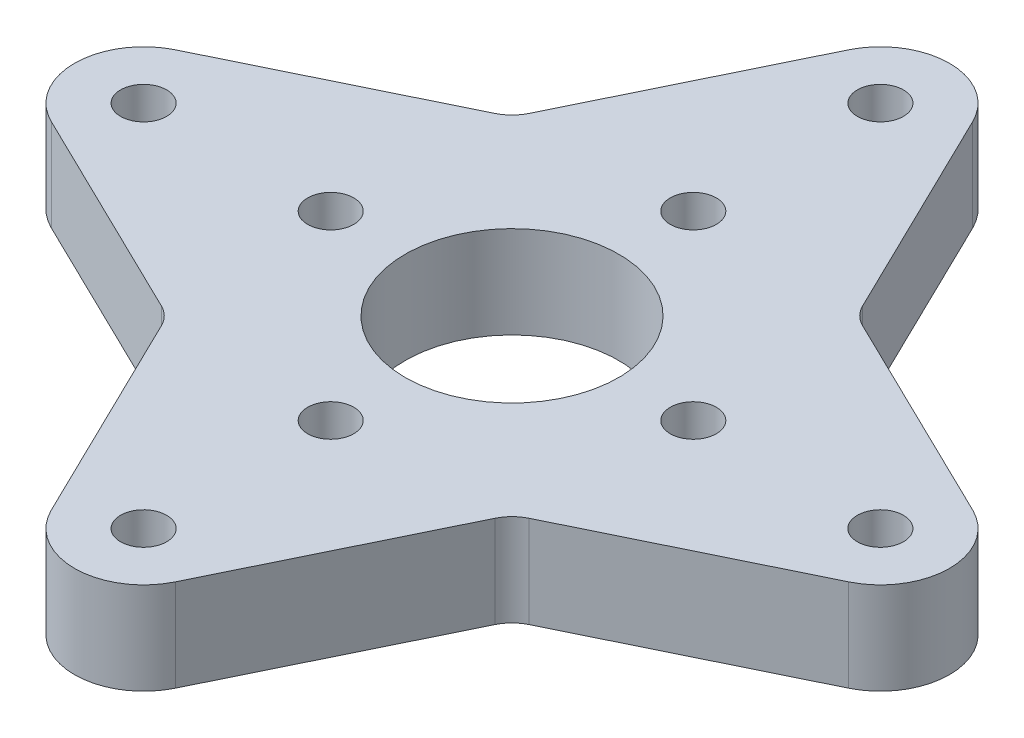
ISO-10303-21;
HEADER;
FILE_DESCRIPTION(('STEP AP214'),'2;1');
FILE_NAME('part.step','',(''),(''),'','','');
FILE_SCHEMA(('AUTOMOTIVE_DESIGN { 1 0 10303 214 1 1 1 1 }'));
ENDSEC;
DATA;
#1=APPLICATION_CONTEXT('core data for automotive mechanical design processes');
#2=APPLICATION_PROTOCOL_DEFINITION('international standard','automotive_design',2000,#1);
#3=PRODUCT_CONTEXT('',#1,'mechanical');
#4=PRODUCT('Part','Part','',(#3));
#5=PRODUCT_RELATED_PRODUCT_CATEGORY('part','',(#4));
#6=PRODUCT_DEFINITION_FORMATION('','',#4);
#7=PRODUCT_DEFINITION_CONTEXT('part definition',#1,'design');
#8=PRODUCT_DEFINITION('design','',#6,#7);
#9=PRODUCT_DEFINITION_SHAPE('','',#8);
#10=(LENGTH_UNIT() NAMED_UNIT(*) SI_UNIT(.MILLI.,.METRE.));
#11=(NAMED_UNIT(*) PLANE_ANGLE_UNIT() SI_UNIT($,.RADIAN.));
#12=(NAMED_UNIT(*) SI_UNIT($,.STERADIAN.) SOLID_ANGLE_UNIT());
#13=UNCERTAINTY_MEASURE_WITH_UNIT(LENGTH_MEASURE(1.E-05),#10,'distance_accuracy_value','');
#14=(GEOMETRIC_REPRESENTATION_CONTEXT(3) GLOBAL_UNCERTAINTY_ASSIGNED_CONTEXT((#13)) GLOBAL_UNIT_ASSIGNED_CONTEXT((#10,
#11,#12)) REPRESENTATION_CONTEXT('',''));
#15=CARTESIAN_POINT('',(0.,0.,0.));
#16=DIRECTION('',(0.,0.,1.));
#17=DIRECTION('',(1.,0.,0.));
#18=AXIS2_PLACEMENT_3D('',#15,#16,#17);
#19=CARTESIAN_POINT('',(13.7833926033585,6.35,13.7833926033584));
#20=DIRECTION('',(0.,1.,0.));
#21=DIRECTION('',(0.,0.,1.));
#22=AXIS2_PLACEMENT_3D('',#19,#20,#21);
#23=PLANE('',#22);
#24=CARTESIAN_POINT('',(-12.5,6.35,-1.50920942409982E-13));
#25=DIRECTION('',(0.,1.,0.));
#26=DIRECTION('',(0.,0.,-1.));
#27=AXIS2_PLACEMENT_3D('',#24,#25,#26);
#28=CIRCLE('',#27,1.5875);
#29=CARTESIAN_POINT('',(-12.5,6.35,-1.58750000000015));
#30=VERTEX_POINT('',#29);
#31=EDGE_CURVE('E311',#30,#30,#28,.T.);
#32=ORIENTED_EDGE('',*,*,#31,.F.);
#33=EDGE_LOOP('',(#32));
#34=FACE_BOUND('',#33,.T.);
#35=CARTESIAN_POINT('',(-2.4980018054066E-13,6.35,25.4));
#36=DIRECTION('',(0.,1.,0.));
#37=DIRECTION('',(0.,0.,-1.));
#38=AXIS2_PLACEMENT_3D('',#35,#36,#37);
#39=CIRCLE('',#38,1.58750000000005);
#40=CARTESIAN_POINT('',(-2.4980018054066E-13,6.35,23.8124999999999));
#41=VERTEX_POINT('',#40);
#42=EDGE_CURVE('E319',#41,#41,#39,.T.);
#43=ORIENTED_EDGE('',*,*,#42,.F.);
#44=EDGE_LOOP('',(#43));
#45=FACE_BOUND('',#44,.T.);
#46=CARTESIAN_POINT('',(25.4,6.35,0.));
#47=DIRECTION('',(0.,1.,0.));
#48=DIRECTION('',(0.,0.,1.));
#49=AXIS2_PLACEMENT_3D('',#46,#47,#48);
#50=CIRCLE('',#49,1.58750000000006);
#51=CARTESIAN_POINT('',(25.4,6.35,1.58750000000006));
#52=VERTEX_POINT('',#51);
#53=EDGE_CURVE('E326',#52,#52,#50,.T.);
#54=ORIENTED_EDGE('',*,*,#53,.F.);
#55=EDGE_LOOP('',(#54));
#56=FACE_BOUND('',#55,.T.);
#57=CARTESIAN_POINT('',(0.,6.35,-25.4));
#58=DIRECTION('',(0.,1.,0.));
#59=DIRECTION('',(0.,0.,1.));
#60=AXIS2_PLACEMENT_3D('',#57,#58,#59);
#61=CIRCLE('',#60,1.58749999999999);
#62=CARTESIAN_POINT('',(0.,6.35,-23.8125));
#63=VERTEX_POINT('',#62);
#64=EDGE_CURVE('E333',#63,#63,#61,.T.);
#65=ORIENTED_EDGE('',*,*,#64,.F.);
#66=EDGE_LOOP('',(#65));
#67=FACE_BOUND('',#66,.T.);
#68=CARTESIAN_POINT('',(13.7833926033585,6.35,13.7833926033584));
#69=DIRECTION('',(0.,-1.,0.));
#70=DIRECTION('',(0.,0.,1.));
#71=AXIS2_PLACEMENT_3D('',#68,#69,#70);
#72=CIRCLE('',#71,2.53999999999999);
#73=CARTESIAN_POINT('',(11.500019865901,6.35,12.6708239799307));
#74=VERTEX_POINT('',#73);
#75=CARTESIAN_POINT('',(12.6708239799308,6.35,11.5000198659009));
#76=VERTEX_POINT('',#75);
#77=EDGE_CURVE('E210',#74,#76,#72,.T.);
#78=ORIENTED_EDGE('',*,*,#77,.T.);
#79=DIRECTION('',(0.898965644668304,0.,-0.438019143081785));
#80=VECTOR('',#79,1.);
#81=CARTESIAN_POINT('',(27.4860661689271,6.35,4.28132388273277));
#82=LINE('',#81,#80);
#83=CARTESIAN_POINT('',(27.4860661689271,6.35,4.28132388273277));
#84=VERTEX_POINT('',#83);
#85=EDGE_CURVE('E118',#76,#84,#82,.T.);
#86=ORIENTED_EDGE('',*,*,#85,.T.);
#87=CARTESIAN_POINT('',(25.4,6.35,0.));
#88=DIRECTION('',(0.,1.,0.));
#89=DIRECTION('',(0.,0.,1.));
#90=AXIS2_PLACEMENT_3D('',#87,#88,#89);
#91=CIRCLE('',#90,4.7625);
#92=CARTESIAN_POINT('',(27.486066168927,6.35,-4.28132388273278));
#93=VERTEX_POINT('',#92);
#94=EDGE_CURVE('E342',#84,#93,#91,.T.);
#95=ORIENTED_EDGE('',*,*,#94,.T.);
#96=DIRECTION('',(-0.898965644668303,0.,-0.438019143081786));
#97=VECTOR('',#96,1.);
#98=CARTESIAN_POINT('',(27.486066168927,6.35,-4.28132388273277));
#99=LINE('',#98,#97);
#100=CARTESIAN_POINT('',(12.6708239799307,6.35,-11.500019865901));
#101=VERTEX_POINT('',#100);
#102=EDGE_CURVE('E344',#93,#101,#99,.T.);
#103=ORIENTED_EDGE('',*,*,#102,.T.);
#104=CARTESIAN_POINT('',(13.7833926033585,6.35,-13.7833926033585));
#105=DIRECTION('',(0.,-1.,0.));
#106=DIRECTION('',(0.,0.,1.));
#107=AXIS2_PLACEMENT_3D('',#104,#105,#106);
#108=CIRCLE('',#107,2.54);
#109=CARTESIAN_POINT('',(11.500019865901,6.35,-12.6708239799307));
#110=VERTEX_POINT('',#109);
#111=EDGE_CURVE('E346',#101,#110,#108,.T.);
#112=ORIENTED_EDGE('',*,*,#111,.T.);
#113=DIRECTION('',(-0.438019143081785,0.,-0.898965644668304));
#114=VECTOR('',#113,1.);
#115=CARTESIAN_POINT('',(4.28132388273283,6.35,-27.486066168927));
#116=LINE('',#115,#114);
#117=CARTESIAN_POINT('',(4.28132388273283,6.35,-27.486066168927));
#118=VERTEX_POINT('',#117);
#119=EDGE_CURVE('E348',#110,#118,#116,.T.);
#120=ORIENTED_EDGE('',*,*,#119,.T.);
#121=CARTESIAN_POINT('',(0.,6.35,-25.4));
#122=DIRECTION('',(0.,1.,0.));
#123=DIRECTION('',(0.,0.,1.));
#124=AXIS2_PLACEMENT_3D('',#121,#122,#123);
#125=CIRCLE('',#124,4.76250000000002);
#126=CARTESIAN_POINT('',(-4.2813238827328,6.35,-27.486066168927));
#127=VERTEX_POINT('',#126);
#128=EDGE_CURVE('E350',#118,#127,#125,.T.);
#129=ORIENTED_EDGE('',*,*,#128,.T.);
#130=DIRECTION('',(-0.438019143081786,0.,0.898965644668303));
#131=VECTOR('',#130,1.);
#132=CARTESIAN_POINT('',(-4.2813238827328,6.35,-27.486066168927));
#133=LINE('',#132,#131);
#134=CARTESIAN_POINT('',(-11.500019865901,6.35,-12.6708239799307));
#135=VERTEX_POINT('',#134);
#136=EDGE_CURVE('E352',#127,#135,#133,.T.);
#137=ORIENTED_EDGE('',*,*,#136,.T.);
#138=CARTESIAN_POINT('',(-13.7833926033585,6.35,-13.7833926033585));
#139=DIRECTION('',(0.,-1.,0.));
#140=DIRECTION('',(0.,0.,1.));
#141=AXIS2_PLACEMENT_3D('',#138,#139,#140);
#142=CIRCLE('',#141,2.54);
#143=CARTESIAN_POINT('',(-12.6708239799307,6.35,-11.500019865901));
#144=VERTEX_POINT('',#143);
#145=EDGE_CURVE('E354',#135,#144,#142,.T.);
#146=ORIENTED_EDGE('',*,*,#145,.T.);
#147=DIRECTION('',(-0.89896564466831,0.,0.438019143081772));
#148=VECTOR('',#147,1.);
#149=CARTESIAN_POINT('',(-27.486066168927,6.35,-4.28132388273311));
#150=LINE('',#149,#148);
#151=CARTESIAN_POINT('',(-27.486066168927,6.35,-4.28132388273311));
#152=VERTEX_POINT('',#151);
#153=EDGE_CURVE('E356',#144,#152,#150,.T.);
#154=ORIENTED_EDGE('',*,*,#153,.T.);
#155=CARTESIAN_POINT('',(-25.4,6.35,-2.70616862252382E-13));
#156=DIRECTION('',(0.,1.,0.));
#157=DIRECTION('',(0.,0.,-1.));
#158=AXIS2_PLACEMENT_3D('',#155,#156,#157);
#159=CIRCLE('',#158,4.76250000000002);
#160=CARTESIAN_POINT('',(-27.486066168927,6.35,4.28132388273252));
#161=VERTEX_POINT('',#160);
#162=EDGE_CURVE('E358',#152,#161,#159,.T.);
#163=ORIENTED_EDGE('',*,*,#162,.T.);
#164=DIRECTION('',(0.898965644668299,0.,0.438019143081795));
#165=VECTOR('',#164,1.);
#166=CARTESIAN_POINT('',(-27.486066168927,6.35,4.28132388273252));
#167=LINE('',#166,#165);
#168=CARTESIAN_POINT('',(-12.6708239799308,6.35,11.5000198659008));
#169=VERTEX_POINT('',#168);
#170=EDGE_CURVE('E360',#161,#169,#167,.T.);
#171=ORIENTED_EDGE('',*,*,#170,.T.);
#172=CARTESIAN_POINT('',(-13.7833926033586,6.35,13.7833926033583));
#173=DIRECTION('',(0.,-1.,0.));
#174=DIRECTION('',(0.,0.,-1.));
#175=AXIS2_PLACEMENT_3D('',#172,#173,#174);
#176=CIRCLE('',#175,2.54);
#177=CARTESIAN_POINT('',(-11.5000198659011,6.35,12.6708239799306));
#178=VERTEX_POINT('',#177);
#179=EDGE_CURVE('E161',#169,#178,#176,.T.);
#180=ORIENTED_EDGE('',*,*,#179,.T.);
#181=DIRECTION('',(0.438019143081777,0.,0.898965644668307));
#182=VECTOR('',#181,1.);
#183=CARTESIAN_POINT('',(-4.28132388273304,6.35,27.486066168927));
#184=LINE('',#183,#182);
#185=CARTESIAN_POINT('',(-4.28132388273304,6.35,27.486066168927));
#186=VERTEX_POINT('',#185);
#187=EDGE_CURVE('E155',#178,#186,#184,.T.);
#188=ORIENTED_EDGE('',*,*,#187,.T.);
#189=CARTESIAN_POINT('',(-2.4980018054066E-13,6.35,25.4));
#190=DIRECTION('',(0.,1.,0.));
#191=DIRECTION('',(0.,0.,-1.));
#192=AXIS2_PLACEMENT_3D('',#189,#190,#191);
#193=CIRCLE('',#192,4.7625);
#194=CARTESIAN_POINT('',(4.28132388273249,6.35,27.4860661689271));
#195=VERTEX_POINT('',#194);
#196=EDGE_CURVE('E159',#186,#195,#193,.T.);
#197=ORIENTED_EDGE('',*,*,#196,.T.);
#198=DIRECTION('',(0.438019143081799,0.,-0.898965644668297));
#199=VECTOR('',#198,1.);
#200=CARTESIAN_POINT('',(4.2813238827325,6.35,27.4860661689271));
#201=LINE('',#200,#199);
#202=EDGE_CURVE('E50',#195,#74,#201,.T.);
#203=ORIENTED_EDGE('',*,*,#202,.T.);
#204=EDGE_LOOP('',(#78,#86,#95,#103,#112,#120,#129,#137,#146,#154,#163,#171,#180,#188,#197,#203));
#205=FACE_BOUND('',#204,.T.);
#206=CARTESIAN_POINT('',(0.,6.35,0.));
#207=DIRECTION('',(0.,1.,0.));
#208=DIRECTION('',(0.,0.,1.));
#209=AXIS2_PLACEMENT_3D('',#206,#207,#208);
#210=CIRCLE('',#209,7.366);
#211=CARTESIAN_POINT('',(0.,6.35,7.366));
#212=VERTEX_POINT('',#211);
#213=EDGE_CURVE('E183',#212,#212,#210,.T.);
#214=ORIENTED_EDGE('',*,*,#213,.F.);
#215=EDGE_LOOP('',(#214));
#216=FACE_BOUND('',#215,.T.);
#217=CARTESIAN_POINT('',(0.,6.35,-12.5));
#218=DIRECTION('',(0.,1.,0.));
#219=DIRECTION('',(0.,0.,1.));
#220=AXIS2_PLACEMENT_3D('',#217,#218,#219);
#221=CIRCLE('',#220,1.5875);
#222=CARTESIAN_POINT('',(0.,6.35,-10.9125));
#223=VERTEX_POINT('',#222);
#224=EDGE_CURVE('E329',#223,#223,#221,.T.);
#225=ORIENTED_EDGE('',*,*,#224,.F.);
#226=EDGE_LOOP('',(#225));
#227=FACE_BOUND('',#226,.T.);
#228=CARTESIAN_POINT('',(12.5,6.35,0.));
#229=DIRECTION('',(0.,1.,0.));
#230=DIRECTION('',(0.,0.,1.));
#231=AXIS2_PLACEMENT_3D('',#228,#229,#230);
#232=CIRCLE('',#231,1.58750000000004);
#233=CARTESIAN_POINT('',(12.5,6.35,1.58750000000004));
#234=VERTEX_POINT('',#233);
#235=EDGE_CURVE('E322',#234,#234,#232,.T.);
#236=ORIENTED_EDGE('',*,*,#235,.F.);
#237=EDGE_LOOP('',(#236));
#238=FACE_BOUND('',#237,.T.);
#239=CARTESIAN_POINT('',(-1.12757025938492E-13,6.35,12.5));
#240=DIRECTION('',(0.,1.,0.));
#241=DIRECTION('',(0.,0.,-1.));
#242=AXIS2_PLACEMENT_3D('',#239,#240,#241);
#243=CIRCLE('',#242,1.58750000000004);
#244=CARTESIAN_POINT('',(-1.12757025938492E-13,6.35,10.9124999999999));
#245=VERTEX_POINT('',#244);
#246=EDGE_CURVE('E316',#245,#245,#243,.T.);
#247=ORIENTED_EDGE('',*,*,#246,.F.);
#248=EDGE_LOOP('',(#247));
#249=FACE_BOUND('',#248,.T.);
#250=CARTESIAN_POINT('',(-25.4,6.35,-2.70616862252382E-13));
#251=DIRECTION('',(0.,1.,0.));
#252=DIRECTION('',(0.,0.,-1.));
#253=AXIS2_PLACEMENT_3D('',#250,#251,#252);
#254=CIRCLE('',#253,1.58749999999999);
#255=CARTESIAN_POINT('',(-25.4,6.35,-1.58750000000026));
#256=VERTEX_POINT('',#255);
#257=EDGE_CURVE('E308',#256,#256,#254,.T.);
#258=ORIENTED_EDGE('',*,*,#257,.F.);
#259=EDGE_LOOP('',(#258));
#260=FACE_BOUND('',#259,.T.);
#261=ADVANCED_FACE('F33',(#34,#45,#56,#67,#205,#216,#227,#238,#249,#260),#23,.T.);
#262=CARTESIAN_POINT('',(13.7833926033585,0.,13.7833926033584));
#263=DIRECTION('',(0.,1.,0.));
#264=DIRECTION('',(0.,0.,1.));
#265=AXIS2_PLACEMENT_3D('',#262,#263,#264);
#266=PLANE('',#265);
#267=CARTESIAN_POINT('',(-1.12757025938492E-13,0.,12.5));
#268=DIRECTION('',(0.,1.,0.));
#269=DIRECTION('',(0.,0.,1.));
#270=AXIS2_PLACEMENT_3D('',#267,#268,#269);
#271=CIRCLE('',#270,4.33750000000003);
#272=CARTESIAN_POINT('',(-1.12757025938492E-13,0.,16.8375));
#273=VERTEX_POINT('',#272);
#274=EDGE_CURVE('E258',#273,#273,#271,.T.);
#275=ORIENTED_EDGE('',*,*,#274,.T.);
#276=EDGE_LOOP('',(#275));
#277=FACE_BOUND('',#276,.T.);
#278=CARTESIAN_POINT('',(-12.5,0.,-1.50920942409982E-13));
#279=DIRECTION('',(0.,1.,0.));
#280=DIRECTION('',(0.,0.,1.));
#281=AXIS2_PLACEMENT_3D('',#278,#279,#280);
#282=CIRCLE('',#281,4.33750000000001);
#283=CARTESIAN_POINT('',(-12.5,0.,4.33749999999986));
#284=VERTEX_POINT('',#283);
#285=EDGE_CURVE('E255',#284,#284,#282,.T.);
#286=ORIENTED_EDGE('',*,*,#285,.T.);
#287=EDGE_LOOP('',(#286));
#288=FACE_BOUND('',#287,.T.);
#289=CARTESIAN_POINT('',(0.,0.,-12.5));
#290=DIRECTION('',(0.,1.,0.));
#291=DIRECTION('',(0.,0.,1.));
#292=AXIS2_PLACEMENT_3D('',#289,#290,#291);
#293=CIRCLE('',#292,4.33749999999999);
#294=CARTESIAN_POINT('',(0.,0.,-8.16250000000001));
#295=VERTEX_POINT('',#294);
#296=EDGE_CURVE('E252',#295,#295,#293,.T.);
#297=ORIENTED_EDGE('',*,*,#296,.T.);
#298=EDGE_LOOP('',(#297));
#299=FACE_BOUND('',#298,.T.);
#300=CARTESIAN_POINT('',(12.5,0.,0.));
#301=DIRECTION('',(0.,1.,0.));
#302=DIRECTION('',(0.,0.,1.));
#303=AXIS2_PLACEMENT_3D('',#300,#301,#302);
#304=CIRCLE('',#303,4.33750000000005);
#305=CARTESIAN_POINT('',(12.5,0.,4.33750000000005));
#306=VERTEX_POINT('',#305);
#307=EDGE_CURVE('E249',#306,#306,#304,.T.);
#308=ORIENTED_EDGE('',*,*,#307,.T.);
#309=EDGE_LOOP('',(#308));
#310=FACE_BOUND('',#309,.T.);
#311=CARTESIAN_POINT('',(-2.4980018054066E-13,0.,25.4));
#312=DIRECTION('',(0.,1.,0.));
#313=DIRECTION('',(0.,0.,-1.));
#314=AXIS2_PLACEMENT_3D('',#311,#312,#313);
#315=CIRCLE('',#314,1.58750000000005);
#316=CARTESIAN_POINT('',(-2.4980018054066E-13,0.,23.8124999999999));
#317=VERTEX_POINT('',#316);
#318=EDGE_CURVE('E289',#317,#317,#315,.T.);
#319=ORIENTED_EDGE('',*,*,#318,.T.);
#320=EDGE_LOOP('',(#319));
#321=FACE_BOUND('',#320,.T.);
#322=CARTESIAN_POINT('',(25.4,0.,0.));
#323=DIRECTION('',(0.,1.,0.));
#324=DIRECTION('',(0.,0.,1.));
#325=AXIS2_PLACEMENT_3D('',#322,#323,#324);
#326=CIRCLE('',#325,1.58750000000006);
#327=CARTESIAN_POINT('',(25.4,0.,1.58750000000006));
#328=VERTEX_POINT('',#327);
#329=EDGE_CURVE('E293',#328,#328,#326,.T.);
#330=ORIENTED_EDGE('',*,*,#329,.T.);
#331=EDGE_LOOP('',(#330));
#332=FACE_BOUND('',#331,.T.);
#333=CARTESIAN_POINT('',(0.,0.,-25.4));
#334=DIRECTION('',(0.,1.,0.));
#335=DIRECTION('',(0.,0.,1.));
#336=AXIS2_PLACEMENT_3D('',#333,#334,#335);
#337=CIRCLE('',#336,1.58749999999999);
#338=CARTESIAN_POINT('',(0.,0.,-23.8125));
#339=VERTEX_POINT('',#338);
#340=EDGE_CURVE('E297',#339,#339,#337,.T.);
#341=ORIENTED_EDGE('',*,*,#340,.T.);
#342=EDGE_LOOP('',(#341));
#343=FACE_BOUND('',#342,.T.);
#344=CARTESIAN_POINT('',(13.7833926033585,0.,13.7833926033584));
#345=DIRECTION('',(0.,-1.,0.));
#346=DIRECTION('',(0.,0.,1.));
#347=AXIS2_PLACEMENT_3D('',#344,#345,#346);
#348=CIRCLE('',#347,2.53999999999999);
#349=CARTESIAN_POINT('',(11.500019865901,0.,12.6708239799307));
#350=VERTEX_POINT('',#349);
#351=CARTESIAN_POINT('',(12.6708239799308,0.,11.5000198659009));
#352=VERTEX_POINT('',#351);
#353=EDGE_CURVE('E179',#350,#352,#348,.T.);
#354=ORIENTED_EDGE('',*,*,#353,.F.);
#355=DIRECTION('',(0.438019143081799,0.,-0.898965644668297));
#356=VECTOR('',#355,1.);
#357=CARTESIAN_POINT('',(4.2813238827325,0.,27.4860661689271));
#358=LINE('',#357,#356);
#359=CARTESIAN_POINT('',(4.28132388273249,0.,27.4860661689271));
#360=VERTEX_POINT('',#359);
#361=EDGE_CURVE('E109',#360,#350,#358,.T.);
#362=ORIENTED_EDGE('',*,*,#361,.F.);
#363=CARTESIAN_POINT('',(-2.4980018054066E-13,0.,25.4));
#364=DIRECTION('',(0.,1.,0.));
#365=DIRECTION('',(0.,0.,-1.));
#366=AXIS2_PLACEMENT_3D('',#363,#364,#365);
#367=CIRCLE('',#366,4.7625);
#368=CARTESIAN_POINT('',(-4.28132388273304,0.,27.486066168927));
#369=VERTEX_POINT('',#368);
#370=EDGE_CURVE('E103',#369,#360,#367,.T.);
#371=ORIENTED_EDGE('',*,*,#370,.F.);
#372=DIRECTION('',(0.438019143081777,0.,0.898965644668307));
#373=VECTOR('',#372,1.);
#374=CARTESIAN_POINT('',(-4.28132388273304,0.,27.486066168927));
#375=LINE('',#374,#373);
#376=CARTESIAN_POINT('',(-11.5000198659011,0.,12.6708239799306));
#377=VERTEX_POINT('',#376);
#378=EDGE_CURVE('E169',#377,#369,#375,.T.);
#379=ORIENTED_EDGE('',*,*,#378,.F.);
#380=CARTESIAN_POINT('',(-13.7833926033586,0.,13.7833926033583));
#381=DIRECTION('',(0.,-1.,0.));
#382=DIRECTION('',(0.,0.,-1.));
#383=AXIS2_PLACEMENT_3D('',#380,#381,#382);
#384=CIRCLE('',#383,2.54);
#385=CARTESIAN_POINT('',(-12.6708239799308,0.,11.5000198659008));
#386=VERTEX_POINT('',#385);
#387=EDGE_CURVE('E205',#386,#377,#384,.T.);
#388=ORIENTED_EDGE('',*,*,#387,.F.);
#389=DIRECTION('',(0.898965644668299,0.,0.438019143081795));
#390=VECTOR('',#389,1.);
#391=CARTESIAN_POINT('',(-27.486066168927,0.,4.28132388273252));
#392=LINE('',#391,#390);
#393=CARTESIAN_POINT('',(-27.486066168927,0.,4.28132388273252));
#394=VERTEX_POINT('',#393);
#395=EDGE_CURVE('E203',#394,#386,#392,.T.);
#396=ORIENTED_EDGE('',*,*,#395,.F.);
#397=CARTESIAN_POINT('',(-25.4,0.,-2.70616862252382E-13));
#398=DIRECTION('',(0.,1.,0.));
#399=DIRECTION('',(0.,0.,-1.));
#400=AXIS2_PLACEMENT_3D('',#397,#398,#399);
#401=CIRCLE('',#400,4.76250000000002);
#402=CARTESIAN_POINT('',(-27.486066168927,0.,-4.28132388273311));
#403=VERTEX_POINT('',#402);
#404=EDGE_CURVE('E201',#403,#394,#401,.T.);
#405=ORIENTED_EDGE('',*,*,#404,.F.);
#406=DIRECTION('',(-0.89896564466831,0.,0.438019143081772));
#407=VECTOR('',#406,1.);
#408=CARTESIAN_POINT('',(-27.486066168927,0.,-4.28132388273311));
#409=LINE('',#408,#407);
#410=CARTESIAN_POINT('',(-12.6708239799307,0.,-11.500019865901));
#411=VERTEX_POINT('',#410);
#412=EDGE_CURVE('E199',#411,#403,#409,.T.);
#413=ORIENTED_EDGE('',*,*,#412,.F.);
#414=CARTESIAN_POINT('',(-13.7833926033585,0.,-13.7833926033585));
#415=DIRECTION('',(0.,-1.,0.));
#416=DIRECTION('',(0.,0.,1.));
#417=AXIS2_PLACEMENT_3D('',#414,#415,#416);
#418=CIRCLE('',#417,2.54);
#419=CARTESIAN_POINT('',(-11.500019865901,0.,-12.6708239799307));
#420=VERTEX_POINT('',#419);
#421=EDGE_CURVE('E197',#420,#411,#418,.T.);
#422=ORIENTED_EDGE('',*,*,#421,.F.);
#423=DIRECTION('',(-0.438019143081786,0.,0.898965644668303));
#424=VECTOR('',#423,1.);
#425=CARTESIAN_POINT('',(-4.2813238827328,0.,-27.486066168927));
#426=LINE('',#425,#424);
#427=CARTESIAN_POINT('',(-4.2813238827328,0.,-27.486066168927));
#428=VERTEX_POINT('',#427);
#429=EDGE_CURVE('E195',#428,#420,#426,.T.);
#430=ORIENTED_EDGE('',*,*,#429,.F.);
#431=CARTESIAN_POINT('',(0.,0.,-25.4));
#432=DIRECTION('',(0.,1.,0.));
#433=DIRECTION('',(0.,0.,1.));
#434=AXIS2_PLACEMENT_3D('',#431,#432,#433);
#435=CIRCLE('',#434,4.76250000000002);
#436=CARTESIAN_POINT('',(4.28132388273283,0.,-27.486066168927));
#437=VERTEX_POINT('',#436);
#438=EDGE_CURVE('E193',#437,#428,#435,.T.);
#439=ORIENTED_EDGE('',*,*,#438,.F.);
#440=DIRECTION('',(-0.438019143081785,0.,-0.898965644668304));
#441=VECTOR('',#440,1.);
#442=CARTESIAN_POINT('',(4.28132388273283,0.,-27.486066168927));
#443=LINE('',#442,#441);
#444=CARTESIAN_POINT('',(11.500019865901,0.,-12.6708239799307));
#445=VERTEX_POINT('',#444);
#446=EDGE_CURVE('E191',#445,#437,#443,.T.);
#447=ORIENTED_EDGE('',*,*,#446,.F.);
#448=CARTESIAN_POINT('',(13.7833926033585,0.,-13.7833926033585));
#449=DIRECTION('',(0.,-1.,0.));
#450=DIRECTION('',(0.,0.,1.));
#451=AXIS2_PLACEMENT_3D('',#448,#449,#450);
#452=CIRCLE('',#451,2.54);
#453=CARTESIAN_POINT('',(12.6708239799307,0.,-11.500019865901));
#454=VERTEX_POINT('',#453);
#455=EDGE_CURVE('E189',#454,#445,#452,.T.);
#456=ORIENTED_EDGE('',*,*,#455,.F.);
#457=DIRECTION('',(-0.898965644668303,0.,-0.438019143081786));
#458=VECTOR('',#457,1.);
#459=CARTESIAN_POINT('',(27.486066168927,0.,-4.28132388273277));
#460=LINE('',#459,#458);
#461=CARTESIAN_POINT('',(27.486066168927,0.,-4.28132388273278));
#462=VERTEX_POINT('',#461);
#463=EDGE_CURVE('E187',#462,#454,#460,.T.);
#464=ORIENTED_EDGE('',*,*,#463,.F.);
#465=CARTESIAN_POINT('',(25.4,0.,0.));
#466=DIRECTION('',(0.,1.,0.));
#467=DIRECTION('',(0.,0.,1.));
#468=AXIS2_PLACEMENT_3D('',#465,#466,#467);
#469=CIRCLE('',#468,4.7625);
#470=CARTESIAN_POINT('',(27.4860661689271,0.,4.28132388273277));
#471=VERTEX_POINT('',#470);
#472=EDGE_CURVE('E185',#471,#462,#469,.T.);
#473=ORIENTED_EDGE('',*,*,#472,.F.);
#474=DIRECTION('',(0.898965644668304,0.,-0.438019143081785));
#475=VECTOR('',#474,1.);
#476=CARTESIAN_POINT('',(27.4860661689271,0.,4.28132388273277));
#477=LINE('',#476,#475);
#478=EDGE_CURVE('E182',#352,#471,#477,.T.);
#479=ORIENTED_EDGE('',*,*,#478,.F.);
#480=EDGE_LOOP('',(#354,#362,#371,#379,#388,#396,#405,#413,#422,#430,#439,#447,#456,#464,#473,#479));
#481=FACE_BOUND('',#480,.T.);
#482=CARTESIAN_POINT('',(0.,0.,0.));
#483=DIRECTION('',(0.,1.,0.));
#484=DIRECTION('',(0.,0.,1.));
#485=AXIS2_PLACEMENT_3D('',#482,#483,#484);
#486=CIRCLE('',#485,7.366);
#487=CARTESIAN_POINT('',(0.,0.,7.366));
#488=VERTEX_POINT('',#487);
#489=EDGE_CURVE('E303',#488,#488,#486,.T.);
#490=ORIENTED_EDGE('',*,*,#489,.T.);
#491=EDGE_LOOP('',(#490));
#492=FACE_BOUND('',#491,.T.);
#493=CARTESIAN_POINT('',(-25.4,0.,-2.70616862252382E-13));
#494=DIRECTION('',(0.,1.,0.));
#495=DIRECTION('',(0.,0.,-1.));
#496=AXIS2_PLACEMENT_3D('',#493,#494,#495);
#497=CIRCLE('',#496,1.58749999999999);
#498=CARTESIAN_POINT('',(-25.4,0.,-1.58750000000026));
#499=VERTEX_POINT('',#498);
#500=EDGE_CURVE('E306',#499,#499,#497,.T.);
#501=ORIENTED_EDGE('',*,*,#500,.T.);
#502=EDGE_LOOP('',(#501));
#503=FACE_BOUND('',#502,.T.);
#504=ADVANCED_FACE('F278',(#277,#288,#299,#310,#321,#332,#343,#481,#492,#503),#266,.F.);
#505=CARTESIAN_POINT('',(13.7833926033585,6.35,13.7833926033584));
#506=DIRECTION('',(0.,-1.,0.));
#507=DIRECTION('',(0.,0.,-1.));
#508=AXIS2_PLACEMENT_3D('',#505,#506,#507);
#509=CYLINDRICAL_SURFACE('',#508,2.53999999999999);
#510=ORIENTED_EDGE('',*,*,#353,.T.);
#511=DIRECTION('',(0.,-1.,0.));
#512=VECTOR('',#511,1.);
#513=CARTESIAN_POINT('',(12.6708239799308,6.35,11.5000198659009));
#514=LINE('',#513,#512);
#515=EDGE_CURVE('E247',#76,#352,#514,.T.);
#516=ORIENTED_EDGE('',*,*,#515,.F.);
#517=ORIENTED_EDGE('',*,*,#77,.F.);
#518=DIRECTION('',(0.,-1.,0.));
#519=VECTOR('',#518,1.);
#520=CARTESIAN_POINT('',(11.500019865901,6.35,12.6708239799307));
#521=LINE('',#520,#519);
#522=EDGE_CURVE('E175',#74,#350,#521,.T.);
#523=ORIENTED_EDGE('',*,*,#522,.T.);
#524=EDGE_LOOP('',(#510,#516,#517,#523));
#525=FACE_BOUND('',#524,.T.);
#526=ADVANCED_FACE('F281',(#525),#509,.F.);
#527=CARTESIAN_POINT('',(27.4860661689271,6.35,4.28132388273277));
#528=DIRECTION('',(-0.438019143081785,0.,-0.898965644668304));
#529=DIRECTION('',(-0.898965644668304,0.,0.438019143081785));
#530=AXIS2_PLACEMENT_3D('',#527,#528,#529);
#531=PLANE('',#530);
#532=ORIENTED_EDGE('',*,*,#478,.T.);
#533=DIRECTION('',(0.,-1.,0.));
#534=VECTOR('',#533,1.);
#535=CARTESIAN_POINT('',(27.4860661689271,6.35,4.28132388273277));
#536=LINE('',#535,#534);
#537=EDGE_CURVE('E244',#84,#471,#536,.T.);
#538=ORIENTED_EDGE('',*,*,#537,.F.);
#539=ORIENTED_EDGE('',*,*,#85,.F.);
#540=ORIENTED_EDGE('',*,*,#515,.T.);
#541=EDGE_LOOP('',(#532,#538,#539,#540));
#542=FACE_BOUND('',#541,.T.);
#543=ADVANCED_FACE('F415',(#542),#531,.F.);
#544=CARTESIAN_POINT('',(25.4,6.35,0.));
#545=DIRECTION('',(0.,-1.,0.));
#546=DIRECTION('',(0.,0.,-1.));
#547=AXIS2_PLACEMENT_3D('',#544,#545,#546);
#548=CYLINDRICAL_SURFACE('',#547,4.7625);
#549=ORIENTED_EDGE('',*,*,#472,.T.);
#550=DIRECTION('',(0.,-1.,0.));
#551=VECTOR('',#550,1.);
#552=CARTESIAN_POINT('',(27.486066168927,6.35,-4.28132388273278));
#553=LINE('',#552,#551);
#554=EDGE_CURVE('E241',#93,#462,#553,.T.);
#555=ORIENTED_EDGE('',*,*,#554,.F.);
#556=ORIENTED_EDGE('',*,*,#94,.F.);
#557=ORIENTED_EDGE('',*,*,#537,.T.);
#558=EDGE_LOOP('',(#549,#555,#556,#557));
#559=FACE_BOUND('',#558,.T.);
#560=ADVANCED_FACE('F413',(#559),#548,.T.);
#561=CARTESIAN_POINT('',(27.486066168927,6.35,-4.28132388273277));
#562=DIRECTION('',(-0.438019143081786,0.,0.898965644668303));
#563=DIRECTION('',(0.898965644668303,0.,0.438019143081787));
#564=AXIS2_PLACEMENT_3D('',#561,#562,#563);
#565=PLANE('',#564);
#566=ORIENTED_EDGE('',*,*,#463,.T.);
#567=DIRECTION('',(0.,-1.,0.));
#568=VECTOR('',#567,1.);
#569=CARTESIAN_POINT('',(12.6708239799307,6.35,-11.500019865901));
#570=LINE('',#569,#568);
#571=EDGE_CURVE('E238',#101,#454,#570,.T.);
#572=ORIENTED_EDGE('',*,*,#571,.F.);
#573=ORIENTED_EDGE('',*,*,#102,.F.);
#574=ORIENTED_EDGE('',*,*,#554,.T.);
#575=EDGE_LOOP('',(#566,#572,#573,#574));
#576=FACE_BOUND('',#575,.T.);
#577=ADVANCED_FACE('F409',(#576),#565,.F.);
#578=CARTESIAN_POINT('',(13.7833926033585,6.35,-13.7833926033585));
#579=DIRECTION('',(0.,-1.,0.));
#580=DIRECTION('',(0.,0.,-1.));
#581=AXIS2_PLACEMENT_3D('',#578,#579,#580);
#582=CYLINDRICAL_SURFACE('',#581,2.54);
#583=ORIENTED_EDGE('',*,*,#455,.T.);
#584=DIRECTION('',(0.,-1.,0.));
#585=VECTOR('',#584,1.);
#586=CARTESIAN_POINT('',(11.500019865901,6.35,-12.6708239799307));
#587=LINE('',#586,#585);
#588=EDGE_CURVE('E235',#110,#445,#587,.T.);
#589=ORIENTED_EDGE('',*,*,#588,.F.);
#590=ORIENTED_EDGE('',*,*,#111,.F.);
#591=ORIENTED_EDGE('',*,*,#571,.T.);
#592=EDGE_LOOP('',(#583,#589,#590,#591));
#593=FACE_BOUND('',#592,.T.);
#594=ADVANCED_FACE('F404',(#593),#582,.F.);
#595=CARTESIAN_POINT('',(4.28132388273283,6.35,-27.486066168927));
#596=DIRECTION('',(-0.898965644668304,0.,0.438019143081785));
#597=DIRECTION('',(0.438019143081785,0.,0.898965644668304));
#598=AXIS2_PLACEMENT_3D('',#595,#596,#597);
#599=PLANE('',#598);
#600=ORIENTED_EDGE('',*,*,#446,.T.);
#601=DIRECTION('',(0.,-1.,0.));
#602=VECTOR('',#601,1.);
#603=CARTESIAN_POINT('',(4.28132388273283,6.35,-27.486066168927));
#604=LINE('',#603,#602);
#605=EDGE_CURVE('E232',#118,#437,#604,.T.);
#606=ORIENTED_EDGE('',*,*,#605,.F.);
#607=ORIENTED_EDGE('',*,*,#119,.F.);
#608=ORIENTED_EDGE('',*,*,#588,.T.);
#609=EDGE_LOOP('',(#600,#606,#607,#608));
#610=FACE_BOUND('',#609,.T.);
#611=ADVANCED_FACE('F398',(#610),#599,.F.);
#612=CARTESIAN_POINT('',(0.,6.35,-25.4));
#613=DIRECTION('',(0.,-1.,0.));
#614=DIRECTION('',(0.,0.,-1.));
#615=AXIS2_PLACEMENT_3D('',#612,#613,#614);
#616=CYLINDRICAL_SURFACE('',#615,4.76250000000002);
#617=ORIENTED_EDGE('',*,*,#438,.T.);
#618=DIRECTION('',(0.,-1.,0.));
#619=VECTOR('',#618,1.);
#620=CARTESIAN_POINT('',(-4.2813238827328,6.35,-27.486066168927));
#621=LINE('',#620,#619);
#622=EDGE_CURVE('E229',#127,#428,#621,.T.);
#623=ORIENTED_EDGE('',*,*,#622,.F.);
#624=ORIENTED_EDGE('',*,*,#128,.F.);
#625=ORIENTED_EDGE('',*,*,#605,.T.);
#626=EDGE_LOOP('',(#617,#623,#624,#625));
#627=FACE_BOUND('',#626,.T.);
#628=ADVANCED_FACE('F394',(#627),#616,.T.);
#629=CARTESIAN_POINT('',(-4.2813238827328,6.35,-27.486066168927));
#630=DIRECTION('',(0.898965644668303,0.,0.438019143081786));
#631=DIRECTION('',(0.438019143081786,0.,-0.898965644668303));
#632=AXIS2_PLACEMENT_3D('',#629,#630,#631);
#633=PLANE('',#632);
#634=ORIENTED_EDGE('',*,*,#429,.T.);
#635=DIRECTION('',(0.,-1.,0.));
#636=VECTOR('',#635,1.);
#637=CARTESIAN_POINT('',(-11.500019865901,6.35,-12.6708239799307));
#638=LINE('',#637,#636);
#639=EDGE_CURVE('E226',#135,#420,#638,.T.);
#640=ORIENTED_EDGE('',*,*,#639,.F.);
#641=ORIENTED_EDGE('',*,*,#136,.F.);
#642=ORIENTED_EDGE('',*,*,#622,.T.);
#643=EDGE_LOOP('',(#634,#640,#641,#642));
#644=FACE_BOUND('',#643,.T.);
#645=ADVANCED_FACE('F389',(#644),#633,.F.);
#646=CARTESIAN_POINT('',(-13.7833926033585,6.35,-13.7833926033585));
#647=DIRECTION('',(0.,-1.,0.));
#648=DIRECTION('',(0.,0.,-1.));
#649=AXIS2_PLACEMENT_3D('',#646,#647,#648);
#650=CYLINDRICAL_SURFACE('',#649,2.54);
#651=ORIENTED_EDGE('',*,*,#421,.T.);
#652=DIRECTION('',(0.,-1.,0.));
#653=VECTOR('',#652,1.);
#654=CARTESIAN_POINT('',(-12.6708239799307,6.35,-11.500019865901));
#655=LINE('',#654,#653);
#656=EDGE_CURVE('E223',#144,#411,#655,.T.);
#657=ORIENTED_EDGE('',*,*,#656,.F.);
#658=ORIENTED_EDGE('',*,*,#145,.F.);
#659=ORIENTED_EDGE('',*,*,#639,.T.);
#660=EDGE_LOOP('',(#651,#657,#658,#659));
#661=FACE_BOUND('',#660,.T.);
#662=ADVANCED_FACE('F383',(#661),#650,.F.);
#663=CARTESIAN_POINT('',(-27.486066168927,6.35,-4.28132388273311));
#664=DIRECTION('',(0.438019143081772,0.,0.89896564466831));
#665=DIRECTION('',(0.89896564466831,0.,-0.438019143081772));
#666=AXIS2_PLACEMENT_3D('',#663,#664,#665);
#667=PLANE('',#666);
#668=ORIENTED_EDGE('',*,*,#412,.T.);
#669=DIRECTION('',(0.,-1.,0.));
#670=VECTOR('',#669,1.);
#671=CARTESIAN_POINT('',(-27.486066168927,6.35,-4.28132388273311));
#672=LINE('',#671,#670);
#673=EDGE_CURVE('E220',#152,#403,#672,.T.);
#674=ORIENTED_EDGE('',*,*,#673,.F.);
#675=ORIENTED_EDGE('',*,*,#153,.F.);
#676=ORIENTED_EDGE('',*,*,#656,.T.);
#677=EDGE_LOOP('',(#668,#674,#675,#676));
#678=FACE_BOUND('',#677,.T.);
#679=ADVANCED_FACE('F379',(#678),#667,.F.);
#680=CARTESIAN_POINT('',(-25.4,6.35,-2.70616862252382E-13));
#681=DIRECTION('',(0.,-1.,0.));
#682=DIRECTION('',(0.,0.,-1.));
#683=AXIS2_PLACEMENT_3D('',#680,#681,#682);
#684=CYLINDRICAL_SURFACE('',#683,4.76250000000002);
#685=ORIENTED_EDGE('',*,*,#404,.T.);
#686=DIRECTION('',(0.,-1.,0.));
#687=VECTOR('',#686,1.);
#688=CARTESIAN_POINT('',(-27.486066168927,6.35,4.28132388273252));
#689=LINE('',#688,#687);
#690=EDGE_CURVE('E217',#161,#394,#689,.T.);
#691=ORIENTED_EDGE('',*,*,#690,.F.);
#692=ORIENTED_EDGE('',*,*,#162,.F.);
#693=ORIENTED_EDGE('',*,*,#673,.T.);
#694=EDGE_LOOP('',(#685,#691,#692,#693));
#695=FACE_BOUND('',#694,.T.);
#696=ADVANCED_FACE('F375',(#695),#684,.T.);
#697=CARTESIAN_POINT('',(-27.486066168927,6.35,4.28132388273252));
#698=DIRECTION('',(0.438019143081794,0.,-0.898965644668299));
#699=DIRECTION('',(-0.898965644668299,0.,-0.438019143081795));
#700=AXIS2_PLACEMENT_3D('',#697,#698,#699);
#701=PLANE('',#700);
#702=ORIENTED_EDGE('',*,*,#395,.T.);
#703=DIRECTION('',(0.,-1.,0.));
#704=VECTOR('',#703,1.);
#705=CARTESIAN_POINT('',(-12.6708239799308,6.35,11.5000198659008));
#706=LINE('',#705,#704);
#707=EDGE_CURVE('E214',#169,#386,#706,.T.);
#708=ORIENTED_EDGE('',*,*,#707,.F.);
#709=ORIENTED_EDGE('',*,*,#170,.F.);
#710=ORIENTED_EDGE('',*,*,#690,.T.);
#711=EDGE_LOOP('',(#702,#708,#709,#710));
#712=FACE_BOUND('',#711,.T.);
#713=ADVANCED_FACE('F366',(#712),#701,.F.);
#714=CARTESIAN_POINT('',(-13.7833926033586,6.35,13.7833926033583));
#715=DIRECTION('',(0.,-1.,0.));
#716=DIRECTION('',(0.,0.,-1.));
#717=AXIS2_PLACEMENT_3D('',#714,#715,#716);
#718=CYLINDRICAL_SURFACE('',#717,2.54);
#719=ORIENTED_EDGE('',*,*,#387,.T.);
#720=DIRECTION('',(0.,-1.,0.));
#721=VECTOR('',#720,1.);
#722=CARTESIAN_POINT('',(-11.5000198659011,6.35,12.6708239799306));
#723=LINE('',#722,#721);
#724=EDGE_CURVE('E170',#178,#377,#723,.T.);
#725=ORIENTED_EDGE('',*,*,#724,.F.);
#726=ORIENTED_EDGE('',*,*,#179,.F.);
#727=ORIENTED_EDGE('',*,*,#707,.T.);
#728=EDGE_LOOP('',(#719,#725,#726,#727));
#729=FACE_BOUND('',#728,.T.);
#730=ADVANCED_FACE('F370',(#729),#718,.F.);
#731=CARTESIAN_POINT('',(-4.28132388273304,6.35,27.486066168927));
#732=DIRECTION('',(0.898965644668308,0.,-0.438019143081777));
#733=DIRECTION('',(-0.438019143081777,0.,-0.898965644668307));
#734=AXIS2_PLACEMENT_3D('',#731,#732,#733);
#735=PLANE('',#734);
#736=ORIENTED_EDGE('',*,*,#378,.T.);
#737=DIRECTION('',(0.,-1.,0.));
#738=VECTOR('',#737,1.);
#739=CARTESIAN_POINT('',(-4.28132388273304,6.35,27.486066168927));
#740=LINE('',#739,#738);
#741=EDGE_CURVE('E166',#186,#369,#740,.T.);
#742=ORIENTED_EDGE('',*,*,#741,.F.);
#743=ORIENTED_EDGE('',*,*,#187,.F.);
#744=ORIENTED_EDGE('',*,*,#724,.T.);
#745=EDGE_LOOP('',(#736,#742,#743,#744));
#746=FACE_BOUND('',#745,.T.);
#747=ADVANCED_FACE('F167',(#746),#735,.F.);
#748=CARTESIAN_POINT('',(-2.4980018054066E-13,6.35,25.4));
#749=DIRECTION('',(0.,-1.,0.));
#750=DIRECTION('',(0.,0.,-1.));
#751=AXIS2_PLACEMENT_3D('',#748,#749,#750);
#752=CYLINDRICAL_SURFACE('',#751,4.7625);
#753=ORIENTED_EDGE('',*,*,#370,.T.);
#754=DIRECTION('',(0.,-1.,0.));
#755=VECTOR('',#754,1.);
#756=CARTESIAN_POINT('',(4.28132388273249,6.35,27.4860661689271));
#757=LINE('',#756,#755);
#758=EDGE_CURVE('E171',#195,#360,#757,.T.);
#759=ORIENTED_EDGE('',*,*,#758,.F.);
#760=ORIENTED_EDGE('',*,*,#196,.F.);
#761=ORIENTED_EDGE('',*,*,#741,.T.);
#762=EDGE_LOOP('',(#753,#759,#760,#761));
#763=FACE_BOUND('',#762,.T.);
#764=ADVANCED_FACE('F173',(#763),#752,.T.);
#765=CARTESIAN_POINT('',(4.2813238827325,6.35,27.4860661689271));
#766=DIRECTION('',(-0.898965644668297,0.,-0.438019143081799));
#767=DIRECTION('',(-0.438019143081799,0.,0.898965644668297));
#768=AXIS2_PLACEMENT_3D('',#765,#766,#767);
#769=PLANE('',#768);
#770=ORIENTED_EDGE('',*,*,#361,.T.);
#771=ORIENTED_EDGE('',*,*,#522,.F.);
#772=ORIENTED_EDGE('',*,*,#202,.F.);
#773=ORIENTED_EDGE('',*,*,#758,.T.);
#774=EDGE_LOOP('',(#770,#771,#772,#773));
#775=FACE_BOUND('',#774,.T.);
#776=ADVANCED_FACE('F418',(#775),#769,.F.);
#777=CARTESIAN_POINT('',(0.,6.35,0.));
#778=DIRECTION('',(0.,-1.,0.));
#779=DIRECTION('',(0.,0.,-1.));
#780=AXIS2_PLACEMENT_3D('',#777,#778,#779);
#781=CYLINDRICAL_SURFACE('',#780,7.366);
#782=ORIENTED_EDGE('',*,*,#213,.T.);
#783=EDGE_LOOP('',(#782));
#784=FACE_BOUND('',#783,.T.);
#785=ORIENTED_EDGE('',*,*,#489,.F.);
#786=EDGE_LOOP('',(#785));
#787=FACE_BOUND('',#786,.T.);
#788=ADVANCED_FACE('F420',(#784,#787),#781,.F.);
#789=CARTESIAN_POINT('',(0.,6.35,-25.4));
#790=DIRECTION('',(0.,-1.,0.));
#791=DIRECTION('',(0.,0.,-1.));
#792=AXIS2_PLACEMENT_3D('',#789,#790,#791);
#793=CYLINDRICAL_SURFACE('',#792,1.58749999999999);
#794=ORIENTED_EDGE('',*,*,#64,.T.);
#795=EDGE_LOOP('',(#794));
#796=FACE_BOUND('',#795,.T.);
#797=ORIENTED_EDGE('',*,*,#340,.F.);
#798=EDGE_LOOP('',(#797));
#799=FACE_BOUND('',#798,.T.);
#800=ADVANCED_FACE('F426',(#796,#799),#793,.F.);
#801=CARTESIAN_POINT('',(0.,6.35,-12.5));
#802=DIRECTION('',(0.,-1.,0.));
#803=DIRECTION('',(0.,0.,-1.));
#804=AXIS2_PLACEMENT_3D('',#801,#802,#803);
#805=CYLINDRICAL_SURFACE('',#804,1.5875);
#806=CARTESIAN_POINT('',(0.,2.75000000000001,-12.5));
#807=DIRECTION('',(0.,1.,0.));
#808=DIRECTION('',(0.,0.,1.));
#809=AXIS2_PLACEMENT_3D('',#806,#807,#808);
#810=CIRCLE('',#809,1.5875);
#811=CARTESIAN_POINT('',(0.,2.75000000000001,-10.9125));
#812=VERTEX_POINT('',#811);
#813=EDGE_CURVE('E42',#812,#812,#810,.F.);
#814=ORIENTED_EDGE('',*,*,#813,.T.);
#815=EDGE_LOOP('',(#814));
#816=FACE_BOUND('',#815,.T.);
#817=ORIENTED_EDGE('',*,*,#224,.T.);
#818=EDGE_LOOP('',(#817));
#819=FACE_BOUND('',#818,.T.);
#820=ADVANCED_FACE('F269',(#816,#819),#805,.F.);
#821=CARTESIAN_POINT('',(25.4,6.35,0.));
#822=DIRECTION('',(0.,-1.,0.));
#823=DIRECTION('',(0.,0.,-1.));
#824=AXIS2_PLACEMENT_3D('',#821,#822,#823);
#825=CYLINDRICAL_SURFACE('',#824,1.58750000000006);
#826=ORIENTED_EDGE('',*,*,#53,.T.);
#827=EDGE_LOOP('',(#826));
#828=FACE_BOUND('',#827,.T.);
#829=ORIENTED_EDGE('',*,*,#329,.F.);
#830=EDGE_LOOP('',(#829));
#831=FACE_BOUND('',#830,.T.);
#832=ADVANCED_FACE('F444',(#828,#831),#825,.F.);
#833=CARTESIAN_POINT('',(12.5,6.35,0.));
#834=DIRECTION('',(0.,-1.,0.));
#835=DIRECTION('',(0.,0.,-1.));
#836=AXIS2_PLACEMENT_3D('',#833,#834,#835);
#837=CYLINDRICAL_SURFACE('',#836,1.58750000000004);
#838=CARTESIAN_POINT('',(12.5,2.75000000000002,0.));
#839=DIRECTION('',(0.,1.,0.));
#840=DIRECTION('',(0.,0.,1.));
#841=AXIS2_PLACEMENT_3D('',#838,#839,#840);
#842=CIRCLE('',#841,1.58750000000004);
#843=CARTESIAN_POINT('',(12.5,2.75000000000002,1.58750000000004));
#844=VERTEX_POINT('',#843);
#845=EDGE_CURVE('E11',#844,#844,#842,.F.);
#846=ORIENTED_EDGE('',*,*,#845,.T.);
#847=EDGE_LOOP('',(#846));
#848=FACE_BOUND('',#847,.T.);
#849=ORIENTED_EDGE('',*,*,#235,.T.);
#850=EDGE_LOOP('',(#849));
#851=FACE_BOUND('',#850,.T.);
#852=ADVANCED_FACE('F447',(#848,#851),#837,.F.);
#853=CARTESIAN_POINT('',(-2.4980018054066E-13,6.35,25.4));
#854=DIRECTION('',(0.,-1.,0.));
#855=DIRECTION('',(0.,0.,-1.));
#856=AXIS2_PLACEMENT_3D('',#853,#854,#855);
#857=CYLINDRICAL_SURFACE('',#856,1.58750000000005);
#858=ORIENTED_EDGE('',*,*,#42,.T.);
#859=EDGE_LOOP('',(#858));
#860=FACE_BOUND('',#859,.T.);
#861=ORIENTED_EDGE('',*,*,#318,.F.);
#862=EDGE_LOOP('',(#861));
#863=FACE_BOUND('',#862,.T.);
#864=ADVANCED_FACE('F451',(#860,#863),#857,.F.);
#865=CARTESIAN_POINT('',(-1.12757025938492E-13,6.35,12.5));
#866=DIRECTION('',(0.,-1.,0.));
#867=DIRECTION('',(0.,0.,-1.));
#868=AXIS2_PLACEMENT_3D('',#865,#866,#867);
#869=CYLINDRICAL_SURFACE('',#868,1.58750000000004);
#870=CARTESIAN_POINT('',(-1.12757025938492E-13,2.75000000000001,12.5));
#871=DIRECTION('',(0.,1.,0.));
#872=DIRECTION('',(0.,0.,1.));
#873=AXIS2_PLACEMENT_3D('',#870,#871,#872);
#874=CIRCLE('',#873,1.58750000000004);
#875=CARTESIAN_POINT('',(-1.12757025938492E-13,2.75000000000001,14.0875));
#876=VERTEX_POINT('',#875);
#877=EDGE_CURVE('E261',#876,#876,#874,.F.);
#878=ORIENTED_EDGE('',*,*,#877,.T.);
#879=EDGE_LOOP('',(#878));
#880=FACE_BOUND('',#879,.T.);
#881=ORIENTED_EDGE('',*,*,#246,.T.);
#882=EDGE_LOOP('',(#881));
#883=FACE_BOUND('',#882,.T.);
#884=ADVANCED_FACE('F455',(#880,#883),#869,.F.);
#885=CARTESIAN_POINT('',(-12.5,6.35,-1.50920942409982E-13));
#886=DIRECTION('',(0.,-1.,0.));
#887=DIRECTION('',(0.,0.,-1.));
#888=AXIS2_PLACEMENT_3D('',#885,#886,#887);
#889=CYLINDRICAL_SURFACE('',#888,1.5875);
#890=CARTESIAN_POINT('',(-12.5,2.75000000000002,-1.50920942409982E-13));
#891=DIRECTION('',(0.,1.,0.));
#892=DIRECTION('',(0.,0.,1.));
#893=AXIS2_PLACEMENT_3D('',#890,#891,#892);
#894=CIRCLE('',#893,1.5875);
#895=CARTESIAN_POINT('',(-12.5,2.75000000000002,1.58749999999985));
#896=VERTEX_POINT('',#895);
#897=EDGE_CURVE('E264',#896,#896,#894,.F.);
#898=ORIENTED_EDGE('',*,*,#897,.T.);
#899=EDGE_LOOP('',(#898));
#900=FACE_BOUND('',#899,.T.);
#901=ORIENTED_EDGE('',*,*,#31,.T.);
#902=EDGE_LOOP('',(#901));
#903=FACE_BOUND('',#902,.T.);
#904=ADVANCED_FACE('F459',(#900,#903),#889,.F.);
#905=CARTESIAN_POINT('',(-25.4,6.35,-2.70616862252382E-13));
#906=DIRECTION('',(0.,-1.,0.));
#907=DIRECTION('',(0.,0.,-1.));
#908=AXIS2_PLACEMENT_3D('',#905,#906,#907);
#909=CYLINDRICAL_SURFACE('',#908,1.58749999999999);
#910=ORIENTED_EDGE('',*,*,#257,.T.);
#911=EDGE_LOOP('',(#910));
#912=FACE_BOUND('',#911,.T.);
#913=ORIENTED_EDGE('',*,*,#500,.F.);
#914=EDGE_LOOP('',(#913));
#915=FACE_BOUND('',#914,.T.);
#916=ADVANCED_FACE('F463',(#912,#915),#909,.F.);
#917=CARTESIAN_POINT('',(-1.12757025938492E-13,0.,12.5));
#918=DIRECTION('',(0.,-1.,0.));
#919=DIRECTION('',(0.,0.,-1.));
#920=AXIS2_PLACEMENT_3D('',#917,#918,#919);
#921=CONICAL_SURFACE('',#920,4.33750000000003,0.785398163397445);
#922=ORIENTED_EDGE('',*,*,#877,.F.);
#923=EDGE_LOOP('',(#922));
#924=FACE_BOUND('',#923,.T.);
#925=ORIENTED_EDGE('',*,*,#274,.F.);
#926=EDGE_LOOP('',(#925));
#927=FACE_BOUND('',#926,.T.);
#928=ADVANCED_FACE('F466',(#924,#927),#921,.F.);
#929=CARTESIAN_POINT('',(-12.5,0.,-1.50920942409982E-13));
#930=DIRECTION('',(0.,-1.,0.));
#931=DIRECTION('',(0.,0.,-1.));
#932=AXIS2_PLACEMENT_3D('',#929,#930,#931);
#933=CONICAL_SURFACE('',#932,4.33750000000001,0.785398163397446);
#934=ORIENTED_EDGE('',*,*,#897,.F.);
#935=EDGE_LOOP('',(#934));
#936=FACE_BOUND('',#935,.T.);
#937=ORIENTED_EDGE('',*,*,#285,.F.);
#938=EDGE_LOOP('',(#937));
#939=FACE_BOUND('',#938,.T.);
#940=ADVANCED_FACE('F275',(#936,#939),#933,.F.);
#941=CARTESIAN_POINT('',(0.,0.,-12.5));
#942=DIRECTION('',(0.,-1.,0.));
#943=DIRECTION('',(0.,0.,-1.));
#944=AXIS2_PLACEMENT_3D('',#941,#942,#943);
#945=CONICAL_SURFACE('',#944,4.33749999999999,0.785398163397446);
#946=ORIENTED_EDGE('',*,*,#813,.F.);
#947=EDGE_LOOP('',(#946));
#948=FACE_BOUND('',#947,.T.);
#949=ORIENTED_EDGE('',*,*,#296,.F.);
#950=EDGE_LOOP('',(#949));
#951=FACE_BOUND('',#950,.T.);
#952=ADVANCED_FACE('F272',(#948,#951),#945,.F.);
#953=CARTESIAN_POINT('',(12.5,0.,0.));
#954=DIRECTION('',(0.,-1.,0.));
#955=DIRECTION('',(0.,0.,-1.));
#956=AXIS2_PLACEMENT_3D('',#953,#954,#955);
#957=CONICAL_SURFACE('',#956,4.33750000000005,0.785398163397446);
#958=ORIENTED_EDGE('',*,*,#845,.F.);
#959=EDGE_LOOP('',(#958));
#960=FACE_BOUND('',#959,.T.);
#961=ORIENTED_EDGE('',*,*,#307,.F.);
#962=EDGE_LOOP('',(#961));
#963=FACE_BOUND('',#962,.T.);
#964=ADVANCED_FACE('F35',(#960,#963),#957,.F.);
#965=CLOSED_SHELL('',(#261,#504,#526,#543,#560,#577,#594,#611,#628,#645,#662,#679,#696,#713,
#730,#747,#764,#776,#788,#800,#820,#832,#852,#864,#884,#904,#916,#928,#940,#952,#964));
#966=MANIFOLD_SOLID_BREP('B2',#965);
#967=ADVANCED_BREP_SHAPE_REPRESENTATION('',(#18,#966),#14);
#968=SHAPE_DEFINITION_REPRESENTATION(#9,#967);
ENDSEC;
END-ISO-10303-21;
